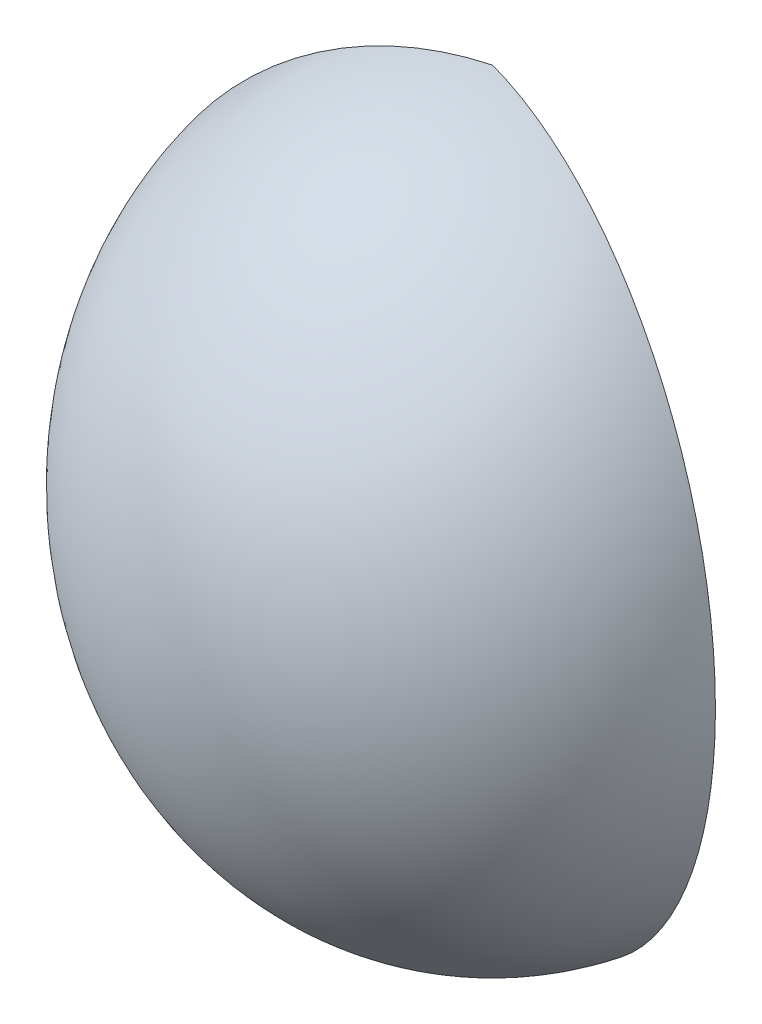
ISO-10303-21;
HEADER;
FILE_DESCRIPTION(('STEP AP214'),'2;1');
FILE_NAME('part.step','',(''),(''),'','','');
FILE_SCHEMA(('AUTOMOTIVE_DESIGN { 1 0 10303 214 1 1 1 1 }'));
ENDSEC;
DATA;
#1=APPLICATION_CONTEXT('core data for automotive mechanical design processes');
#2=APPLICATION_PROTOCOL_DEFINITION('international standard','automotive_design',2000,#1);
#3=PRODUCT_CONTEXT('',#1,'mechanical');
#4=PRODUCT('Part','Part','',(#3));
#5=PRODUCT_RELATED_PRODUCT_CATEGORY('part','',(#4));
#6=PRODUCT_DEFINITION_FORMATION('','',#4);
#7=PRODUCT_DEFINITION_CONTEXT('part definition',#1,'design');
#8=PRODUCT_DEFINITION('design','',#6,#7);
#9=PRODUCT_DEFINITION_SHAPE('','',#8);
#10=(LENGTH_UNIT() NAMED_UNIT(*) SI_UNIT(.MILLI.,.METRE.));
#11=(NAMED_UNIT(*) PLANE_ANGLE_UNIT() SI_UNIT($,.RADIAN.));
#12=(NAMED_UNIT(*) SI_UNIT($,.STERADIAN.) SOLID_ANGLE_UNIT());
#13=UNCERTAINTY_MEASURE_WITH_UNIT(LENGTH_MEASURE(1.E-05),#10,'distance_accuracy_value','');
#14=(GEOMETRIC_REPRESENTATION_CONTEXT(3) GLOBAL_UNCERTAINTY_ASSIGNED_CONTEXT((#13)) GLOBAL_UNIT_ASSIGNED_CONTEXT((#10,
#11,#12)) REPRESENTATION_CONTEXT('',''));
#15=CARTESIAN_POINT('',(0.,0.,0.));
#16=DIRECTION('',(0.,0.,1.));
#17=DIRECTION('',(1.,0.,0.));
#18=AXIS2_PLACEMENT_3D('',#15,#16,#17);
#19=CARTESIAN_POINT('',(0.,0.,0.));
#20=DIRECTION('',(0.258819045102518,0.,0.965925826289069));
#21=DIRECTION('',(0.,1.,0.));
#22=AXIS2_PLACEMENT_3D('',#19,#20,#21);
#23=ELLIPSE('',#22,15.,13.);
#24=TRIMMED_CURVE('',#23,(PARAMETER_VALUE(0.)),(PARAMETER_VALUE(3.14159265358979)),.T.,.PARAMETER.);
#25=CARTESIAN_POINT('',(0.,15.,0.));
#26=DIRECTION('',(0.,1.,0.));
#27=AXIS1_PLACEMENT('',#25,#26);
#28=SURFACE_OF_REVOLUTION('',#24,#27);
#29=CARTESIAN_POINT('',(0.,0.,0.));
#30=DIRECTION('',(0.258819045102518,0.,-0.965925826289069));
#31=DIRECTION('',(0.,1.,0.));
#32=AXIS2_PLACEMENT_3D('',#29,#30,#31);
#33=ELLIPSE('',#32,15.,13.);
#34=CARTESIAN_POINT('',(0.,15.,0.));
#35=VERTEX_POINT('',#34);
#36=CARTESIAN_POINT('',(0.,-15.,0.));
#37=VERTEX_POINT('',#36);
#38=EDGE_CURVE('E51',#35,#37,#33,.T.);
#39=ORIENTED_EDGE('',*,*,#38,.F.);
#40=EDGE_CURVE('E66',#35,#37,#23,.T.);
#41=ORIENTED_EDGE('',*,*,#40,.T.);
#42=EDGE_LOOP('',(#39,#41));
#43=FACE_BOUND('',#42,.T.);
#44=ADVANCED_FACE('F37',(#43),#28,.F.);
#45=CARTESIAN_POINT('',(0.,14.5,0.));
#46=CARTESIAN_POINT('',(-1.57076633007967,14.5,0.42088556964284));
#47=CARTESIAN_POINT('',(-3.1412839628157,14.1274083896375,0.841704501033294));
#48=CARTESIAN_POINT('',(-6.05292960669707,12.6867302638563,1.6218775999569));
#49=CARTESIAN_POINT('',(-7.39289948700811,11.618579761241,1.98092144726826));
#50=CARTESIAN_POINT('',(-9.63549116047822,8.93969313593761,2.58182207512733));
#51=CARTESIAN_POINT('',(-10.53681885219,7.3299409413058,2.8233321022373));
#52=CARTESIAN_POINT('',(-11.7564366309988,3.81268833121722,3.15012770114376));
#53=CARTESIAN_POINT('',(-12.0740728286134,1.90677220780381,3.23523806378147));
#54=CARTESIAN_POINT('',(-12.0740728286134,-1.9067722078038,3.23523806378147));
#55=CARTESIAN_POINT('',(-11.7564366309988,-3.81268833121722,3.15012770114376));
#56=CARTESIAN_POINT('',(-10.53681885219,-7.3299409413058,2.8233321022373));
#57=CARTESIAN_POINT('',(-9.63549116047822,-8.93969313593761,2.58182207512733));
#58=CARTESIAN_POINT('',(-7.39289948700811,-11.618579761241,1.98092144726826));
#59=CARTESIAN_POINT('',(-6.05292960669708,-12.6867302638563,1.6218775999569));
#60=CARTESIAN_POINT('',(-3.1412839628157,-14.1274083896375,0.841704501033295));
#61=CARTESIAN_POINT('',(-1.57076633007967,-14.5,0.42088556964284));
#62=CARTESIAN_POINT('',(0.,-14.5,0.));
#63=B_SPLINE_CURVE_WITH_KNOTS('',3,(#45,#46,#47,#48,#49,#50,#51,#52,#53,#54,#55,#56,#57,#58,#59,
#60,#61,#62),.UNSPECIFIED.,.F.,.F.,(4,2,2,2,2,2,2,2,4),(0.,0.125,0.25,0.375,0.5,0.625,0.75,
0.875,1.),.UNSPECIFIED.);
#64=CARTESIAN_POINT('',(0.,15.,0.));
#65=DIRECTION('',(0.,1.,0.));
#66=AXIS1_PLACEMENT('',#64,#65);
#67=SURFACE_OF_REVOLUTION('',#63,#66);
#68=CARTESIAN_POINT('',(0.,14.5,0.));
#69=CARTESIAN_POINT('',(1.57076633007967,14.5,0.42088556964284));
#70=CARTESIAN_POINT('',(3.1412839628157,14.1274083896375,0.841704501033294));
#71=CARTESIAN_POINT('',(6.05292960669707,12.6867302638563,1.6218775999569));
#72=CARTESIAN_POINT('',(7.39289948700811,11.618579761241,1.98092144726826));
#73=CARTESIAN_POINT('',(9.63549116047822,8.93969313593761,2.58182207512733));
#74=CARTESIAN_POINT('',(10.53681885219,7.3299409413058,2.8233321022373));
#75=CARTESIAN_POINT('',(11.7564366309988,3.81268833121722,3.15012770114376));
#76=CARTESIAN_POINT('',(12.0740728286134,1.90677220780381,3.23523806378147));
#77=CARTESIAN_POINT('',(12.0740728286134,-1.9067722078038,3.23523806378147));
#78=CARTESIAN_POINT('',(11.7564366309988,-3.81268833121722,3.15012770114376));
#79=CARTESIAN_POINT('',(10.53681885219,-7.3299409413058,2.8233321022373));
#80=CARTESIAN_POINT('',(9.63549116047822,-8.93969313593761,2.58182207512733));
#81=CARTESIAN_POINT('',(7.39289948700811,-11.618579761241,1.98092144726826));
#82=CARTESIAN_POINT('',(6.05292960669708,-12.6867302638563,1.6218775999569));
#83=CARTESIAN_POINT('',(3.1412839628157,-14.1274083896375,0.841704501033295));
#84=CARTESIAN_POINT('',(1.57076633007967,-14.5,0.42088556964284));
#85=CARTESIAN_POINT('',(0.,-14.5,0.));
#86=B_SPLINE_CURVE_WITH_KNOTS('',3,(#68,#69,#70,#71,#72,#73,#74,#75,#76,#77,#78,#79,#80,#81,#82,
#83,#84,#85),.UNSPECIFIED.,.F.,.F.,(4,2,2,2,2,2,2,2,4),(0.,0.125,0.25,0.375,0.5,0.625,0.75,
0.875,1.),.UNSPECIFIED.);
#87=CARTESIAN_POINT('',(0.,14.5,0.));
#88=VERTEX_POINT('',#87);
#89=CARTESIAN_POINT('',(0.,-14.5,0.));
#90=VERTEX_POINT('',#89);
#91=EDGE_CURVE('E71',#88,#90,#86,.T.);
#92=ORIENTED_EDGE('',*,*,#91,.T.);
#93=EDGE_CURVE('E45',#88,#90,#63,.T.);
#94=ORIENTED_EDGE('',*,*,#93,.F.);
#95=EDGE_LOOP('',(#92,#94));
#96=FACE_BOUND('',#95,.T.);
#97=ADVANCED_FACE('F39',(#96),#67,.T.);
#98=CARTESIAN_POINT('',(0.,0.,0.));
#99=DIRECTION('',(0.258819045102518,0.,0.965925826289069));
#100=DIRECTION('',(0.965925826289069,0.,-0.258819045102518));
#101=AXIS2_PLACEMENT_3D('',#98,#99,#100);
#102=PLANE('',#101);
#103=ORIENTED_EDGE('',*,*,#40,.F.);
#104=DIRECTION('',(0.,-1.,0.));
#105=VECTOR('',#104,1.);
#106=CARTESIAN_POINT('',(0.,15.,0.));
#107=LINE('',#106,#105);
#108=EDGE_CURVE('E11',#35,#88,#107,.T.);
#109=ORIENTED_EDGE('',*,*,#108,.T.);
#110=ORIENTED_EDGE('',*,*,#93,.T.);
#111=DIRECTION('',(0.,-1.,0.));
#112=VECTOR('',#111,1.);
#113=CARTESIAN_POINT('',(0.,-14.5,0.));
#114=LINE('',#113,#112);
#115=EDGE_CURVE('E64',#90,#37,#114,.T.);
#116=ORIENTED_EDGE('',*,*,#115,.T.);
#117=EDGE_LOOP('',(#103,#109,#110,#116));
#118=FACE_BOUND('',#117,.T.);
#119=ADVANCED_FACE('F65',(#118),#102,.F.);
#120=CARTESIAN_POINT('',(0.,0.,0.));
#121=DIRECTION('',(0.258819045102518,0.,-0.965925826289069));
#122=DIRECTION('',(-0.965925826289069,0.,-0.258819045102518));
#123=AXIS2_PLACEMENT_3D('',#120,#121,#122);
#124=PLANE('',#123);
#125=ORIENTED_EDGE('',*,*,#38,.T.);
#126=ORIENTED_EDGE('',*,*,#115,.F.);
#127=ORIENTED_EDGE('',*,*,#91,.F.);
#128=ORIENTED_EDGE('',*,*,#108,.F.);
#129=EDGE_LOOP('',(#125,#126,#127,#128));
#130=FACE_BOUND('',#129,.T.);
#131=ADVANCED_FACE('F70',(#130),#124,.T.);
#132=CLOSED_SHELL('',(#44,#97,#119,#131));
#133=MANIFOLD_SOLID_BREP('B2',#132);
#134=ADVANCED_BREP_SHAPE_REPRESENTATION('',(#18,#133),#14);
#135=SHAPE_DEFINITION_REPRESENTATION(#9,#134);
ENDSEC;
END-ISO-10303-21;
